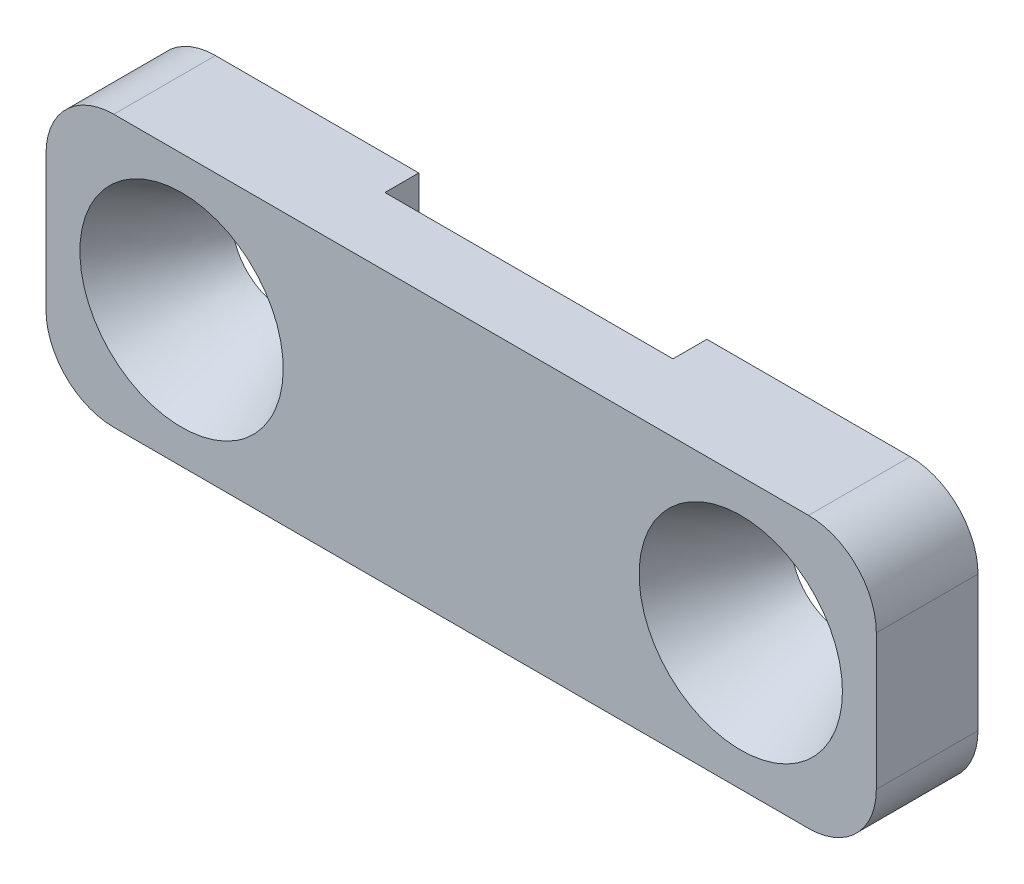
ISO-10303-21;
HEADER;
FILE_DESCRIPTION(('STEP AP214'),'2;1');
FILE_NAME('part.step','',(''),(''),'','','');
FILE_SCHEMA(('AUTOMOTIVE_DESIGN { 1 0 10303 214 1 1 1 1 }'));
ENDSEC;
DATA;
#1=APPLICATION_CONTEXT('core data for automotive mechanical design processes');
#2=APPLICATION_PROTOCOL_DEFINITION('international standard','automotive_design',2000,#1);
#3=PRODUCT_CONTEXT('',#1,'mechanical');
#4=PRODUCT('Part','Part','',(#3));
#5=PRODUCT_RELATED_PRODUCT_CATEGORY('part','',(#4));
#6=PRODUCT_DEFINITION_FORMATION('','',#4);
#7=PRODUCT_DEFINITION_CONTEXT('part definition',#1,'design');
#8=PRODUCT_DEFINITION('design','',#6,#7);
#9=PRODUCT_DEFINITION_SHAPE('','',#8);
#10=(LENGTH_UNIT() NAMED_UNIT(*) SI_UNIT(.MILLI.,.METRE.));
#11=(NAMED_UNIT(*) PLANE_ANGLE_UNIT() SI_UNIT($,.RADIAN.));
#12=(NAMED_UNIT(*) SI_UNIT($,.STERADIAN.) SOLID_ANGLE_UNIT());
#13=UNCERTAINTY_MEASURE_WITH_UNIT(LENGTH_MEASURE(1.E-05),#10,'distance_accuracy_value','');
#14=(GEOMETRIC_REPRESENTATION_CONTEXT(3) GLOBAL_UNCERTAINTY_ASSIGNED_CONTEXT((#13)) GLOBAL_UNIT_ASSIGNED_CONTEXT((#10,
#11,#12)) REPRESENTATION_CONTEXT('',''));
#15=CARTESIAN_POINT('',(0.,0.,0.));
#16=DIRECTION('',(0.,0.,1.));
#17=DIRECTION('',(1.,0.,0.));
#18=AXIS2_PLACEMENT_3D('',#15,#16,#17);
#19=CARTESIAN_POINT('',(-12.25,4.,3.));
#20=DIRECTION('',(0.,-1.,0.));
#21=DIRECTION('',(0.,0.,-1.));
#22=AXIS2_PLACEMENT_3D('',#19,#20,#21);
#23=PLANE('',#22);
#24=DIRECTION('',(-1.,0.,0.));
#25=VECTOR('',#24,1.);
#26=CARTESIAN_POINT('',(-12.25,4.,3.));
#27=LINE('',#26,#25);
#28=CARTESIAN_POINT('',(10.25,4.,3.));
#29=VERTEX_POINT('',#28);
#30=CARTESIAN_POINT('',(-10.25,4.,3.));
#31=VERTEX_POINT('',#30);
#32=EDGE_CURVE('E170',#29,#31,#27,.T.);
#33=ORIENTED_EDGE('',*,*,#32,.F.);
#34=DIRECTION('',(0.,0.,-1.));
#35=VECTOR('',#34,1.);
#36=CARTESIAN_POINT('',(10.25,4.,3.));
#37=LINE('',#36,#35);
#38=CARTESIAN_POINT('',(10.25,4.,0.));
#39=VERTEX_POINT('',#38);
#40=EDGE_CURVE('E230',#29,#39,#37,.T.);
#41=ORIENTED_EDGE('',*,*,#40,.T.);
#42=DIRECTION('',(-1.,0.,0.));
#43=VECTOR('',#42,1.);
#44=CARTESIAN_POINT('',(-12.25,4.,0.));
#45=LINE('',#44,#43);
#46=CARTESIAN_POINT('',(4.25,4.,0.));
#47=VERTEX_POINT('',#46);
#48=EDGE_CURVE('E184',#39,#47,#45,.T.);
#49=ORIENTED_EDGE('',*,*,#48,.T.);
#50=DIRECTION('',(0.,0.,-1.));
#51=VECTOR('',#50,1.);
#52=CARTESIAN_POINT('',(4.25,4.,1.));
#53=LINE('',#52,#51);
#54=CARTESIAN_POINT('',(4.25,4.,1.));
#55=VERTEX_POINT('',#54);
#56=EDGE_CURVE('E136',#55,#47,#53,.T.);
#57=ORIENTED_EDGE('',*,*,#56,.F.);
#58=DIRECTION('',(1.,0.,0.));
#59=VECTOR('',#58,1.);
#60=CARTESIAN_POINT('',(0.,4.,1.));
#61=LINE('',#60,#59);
#62=CARTESIAN_POINT('',(-4.25,4.,1.));
#63=VERTEX_POINT('',#62);
#64=EDGE_CURVE('E143',#63,#55,#61,.T.);
#65=ORIENTED_EDGE('',*,*,#64,.F.);
#66=DIRECTION('',(0.,0.,-1.));
#67=VECTOR('',#66,1.);
#68=CARTESIAN_POINT('',(-4.25,4.,1.));
#69=LINE('',#68,#67);
#70=CARTESIAN_POINT('',(-4.25,4.,0.));
#71=VERTEX_POINT('',#70);
#72=EDGE_CURVE('E124',#63,#71,#69,.T.);
#73=ORIENTED_EDGE('',*,*,#72,.T.);
#74=CARTESIAN_POINT('',(-10.25,4.,0.));
#75=VERTEX_POINT('',#74);
#76=EDGE_CURVE('E183',#71,#75,#45,.T.);
#77=ORIENTED_EDGE('',*,*,#76,.T.);
#78=DIRECTION('',(0.,0.,-1.));
#79=VECTOR('',#78,1.);
#80=CARTESIAN_POINT('',(-10.25,4.,3.));
#81=LINE('',#80,#79);
#82=EDGE_CURVE('E180',#75,#31,#81,.F.);
#83=ORIENTED_EDGE('',*,*,#82,.T.);
#84=EDGE_LOOP('',(#33,#41,#49,#57,#65,#73,#77,#83));
#85=FACE_BOUND('',#84,.T.);
#86=ADVANCED_FACE('F37',(#85),#23,.F.);
#87=CARTESIAN_POINT('',(-12.25,-4.,3.));
#88=DIRECTION('',(0.,1.,0.));
#89=DIRECTION('',(0.,0.,1.));
#90=AXIS2_PLACEMENT_3D('',#87,#88,#89);
#91=PLANE('',#90);
#92=DIRECTION('',(1.,0.,0.));
#93=VECTOR('',#92,1.);
#94=CARTESIAN_POINT('',(-12.25,-4.,0.));
#95=LINE('',#94,#93);
#96=CARTESIAN_POINT('',(4.25,-4.,0.));
#97=VERTEX_POINT('',#96);
#98=CARTESIAN_POINT('',(10.25,-4.,0.));
#99=VERTEX_POINT('',#98);
#100=EDGE_CURVE('E188',#97,#99,#95,.T.);
#101=ORIENTED_EDGE('',*,*,#100,.T.);
#102=DIRECTION('',(0.,0.,-1.));
#103=VECTOR('',#102,1.);
#104=CARTESIAN_POINT('',(10.25,-4.,3.));
#105=LINE('',#104,#103);
#106=CARTESIAN_POINT('',(10.25,-4.,3.));
#107=VERTEX_POINT('',#106);
#108=EDGE_CURVE('E253',#99,#107,#105,.F.);
#109=ORIENTED_EDGE('',*,*,#108,.T.);
#110=DIRECTION('',(1.,0.,0.));
#111=VECTOR('',#110,1.);
#112=CARTESIAN_POINT('',(-12.25,-4.,3.));
#113=LINE('',#112,#111);
#114=CARTESIAN_POINT('',(-10.25,-4.,3.));
#115=VERTEX_POINT('',#114);
#116=EDGE_CURVE('E177',#115,#107,#113,.T.);
#117=ORIENTED_EDGE('',*,*,#116,.F.);
#118=DIRECTION('',(0.,0.,-1.));
#119=VECTOR('',#118,1.);
#120=CARTESIAN_POINT('',(-10.25,-4.,3.));
#121=LINE('',#120,#119);
#122=CARTESIAN_POINT('',(-10.25,-4.,0.));
#123=VERTEX_POINT('',#122);
#124=EDGE_CURVE('E250',#115,#123,#121,.T.);
#125=ORIENTED_EDGE('',*,*,#124,.T.);
#126=CARTESIAN_POINT('',(-4.25,-4.,0.));
#127=VERTEX_POINT('',#126);
#128=EDGE_CURVE('E171',#123,#127,#95,.T.);
#129=ORIENTED_EDGE('',*,*,#128,.T.);
#130=DIRECTION('',(0.,0.,-1.));
#131=VECTOR('',#130,1.);
#132=CARTESIAN_POINT('',(-4.25,-4.,1.));
#133=LINE('',#132,#131);
#134=CARTESIAN_POINT('',(-4.25,-4.,1.));
#135=VERTEX_POINT('',#134);
#136=EDGE_CURVE('E160',#135,#127,#133,.T.);
#137=ORIENTED_EDGE('',*,*,#136,.F.);
#138=DIRECTION('',(-1.,0.,0.));
#139=VECTOR('',#138,1.);
#140=CARTESIAN_POINT('',(0.,-4.,1.));
#141=LINE('',#140,#139);
#142=CARTESIAN_POINT('',(4.25,-4.,1.));
#143=VERTEX_POINT('',#142);
#144=EDGE_CURVE('E137',#143,#135,#141,.T.);
#145=ORIENTED_EDGE('',*,*,#144,.F.);
#146=DIRECTION('',(0.,0.,-1.));
#147=VECTOR('',#146,1.);
#148=CARTESIAN_POINT('',(4.25,-4.,1.));
#149=LINE('',#148,#147);
#150=EDGE_CURVE('E163',#143,#97,#149,.T.);
#151=ORIENTED_EDGE('',*,*,#150,.T.);
#152=EDGE_LOOP('',(#101,#109,#117,#125,#129,#137,#145,#151));
#153=FACE_BOUND('',#152,.T.);
#154=ADVANCED_FACE('F286',(#153),#91,.F.);
#155=CARTESIAN_POINT('',(0.,0.,0.));
#156=DIRECTION('',(0.,0.,-1.));
#157=DIRECTION('',(-1.,0.,0.));
#158=AXIS2_PLACEMENT_3D('',#155,#156,#157);
#159=PLANE('',#158);
#160=CARTESIAN_POINT('',(-8.25,0.,0.));
#161=DIRECTION('',(0.,0.,-1.));
#162=DIRECTION('',(-1.,0.,0.));
#163=AXIS2_PLACEMENT_3D('',#160,#161,#162);
#164=CIRCLE('',#163,1.5);
#165=CARTESIAN_POINT('',(-8.70005985936191,1.43088997585109,0.));
#166=VERTEX_POINT('',#165);
#167=EDGE_CURVE('E158',#166,#166,#164,.T.);
#168=ORIENTED_EDGE('',*,*,#167,.F.);
#169=EDGE_LOOP('',(#168));
#170=FACE_BOUND('',#169,.T.);
#171=DIRECTION('',(0.,-1.,0.));
#172=VECTOR('',#171,1.);
#173=CARTESIAN_POINT('',(-12.25,-4.,0.));
#174=LINE('',#173,#172);
#175=CARTESIAN_POINT('',(-12.25,2.,0.));
#176=VERTEX_POINT('',#175);
#177=CARTESIAN_POINT('',(-12.25,-2.,0.));
#178=VERTEX_POINT('',#177);
#179=EDGE_CURVE('E186',#176,#178,#174,.T.);
#180=ORIENTED_EDGE('',*,*,#179,.F.);
#181=CARTESIAN_POINT('',(-10.25,2.,0.));
#182=DIRECTION('',(0.,0.,-1.));
#183=DIRECTION('',(-1.,0.,0.));
#184=AXIS2_PLACEMENT_3D('',#181,#182,#183);
#185=CIRCLE('',#184,2.);
#186=EDGE_CURVE('E12',#176,#75,#185,.T.);
#187=ORIENTED_EDGE('',*,*,#186,.T.);
#188=ORIENTED_EDGE('',*,*,#76,.F.);
#189=DIRECTION('',(0.,-1.,0.));
#190=VECTOR('',#189,1.);
#191=CARTESIAN_POINT('',(-4.25,0.,0.));
#192=LINE('',#191,#190);
#193=EDGE_CURVE('E131',#71,#127,#192,.T.);
#194=ORIENTED_EDGE('',*,*,#193,.T.);
#195=ORIENTED_EDGE('',*,*,#128,.F.);
#196=CARTESIAN_POINT('',(-10.25,-2.,0.));
#197=DIRECTION('',(0.,0.,-1.));
#198=DIRECTION('',(-1.,0.,0.));
#199=AXIS2_PLACEMENT_3D('',#196,#197,#198);
#200=CIRCLE('',#199,2.);
#201=EDGE_CURVE('E45',#123,#178,#200,.T.);
#202=ORIENTED_EDGE('',*,*,#201,.T.);
#203=EDGE_LOOP('',(#180,#187,#188,#194,#195,#202));
#204=FACE_BOUND('',#203,.T.);
#205=ADVANCED_FACE('F262',(#170,#204),#159,.T.);
#206=CARTESIAN_POINT('',(12.25,-4.,3.));
#207=DIRECTION('',(-1.,0.,0.));
#208=DIRECTION('',(0.,0.,1.));
#209=AXIS2_PLACEMENT_3D('',#206,#207,#208);
#210=PLANE('',#209);
#211=DIRECTION('',(0.,1.,0.));
#212=VECTOR('',#211,1.);
#213=CARTESIAN_POINT('',(12.25,-4.,0.));
#214=LINE('',#213,#212);
#215=CARTESIAN_POINT('',(12.25,-2.,0.));
#216=VERTEX_POINT('',#215);
#217=CARTESIAN_POINT('',(12.25,2.,0.));
#218=VERTEX_POINT('',#217);
#219=EDGE_CURVE('E162',#216,#218,#214,.T.);
#220=ORIENTED_EDGE('',*,*,#219,.T.);
#221=DIRECTION('',(0.,0.,-1.));
#222=VECTOR('',#221,1.);
#223=CARTESIAN_POINT('',(12.25,2.,3.));
#224=LINE('',#223,#222);
#225=CARTESIAN_POINT('',(12.25,2.,3.));
#226=VERTEX_POINT('',#225);
#227=EDGE_CURVE('E240',#218,#226,#224,.F.);
#228=ORIENTED_EDGE('',*,*,#227,.T.);
#229=DIRECTION('',(0.,1.,0.));
#230=VECTOR('',#229,1.);
#231=CARTESIAN_POINT('',(12.25,-4.,3.));
#232=LINE('',#231,#230);
#233=CARTESIAN_POINT('',(12.25,-2.,3.));
#234=VERTEX_POINT('',#233);
#235=EDGE_CURVE('E167',#234,#226,#232,.T.);
#236=ORIENTED_EDGE('',*,*,#235,.F.);
#237=DIRECTION('',(0.,0.,-1.));
#238=VECTOR('',#237,1.);
#239=CARTESIAN_POINT('',(12.25,-2.,3.));
#240=LINE('',#239,#238);
#241=EDGE_CURVE('E237',#234,#216,#240,.T.);
#242=ORIENTED_EDGE('',*,*,#241,.T.);
#243=EDGE_LOOP('',(#220,#228,#236,#242));
#244=FACE_BOUND('',#243,.T.);
#245=ADVANCED_FACE('F276',(#244),#210,.F.);
#246=CARTESIAN_POINT('',(-12.25,-4.,3.));
#247=DIRECTION('',(1.,0.,0.));
#248=DIRECTION('',(0.,0.,-1.));
#249=AXIS2_PLACEMENT_3D('',#246,#247,#248);
#250=PLANE('',#249);
#251=DIRECTION('',(0.,-1.,0.));
#252=VECTOR('',#251,1.);
#253=CARTESIAN_POINT('',(-12.25,-4.,3.));
#254=LINE('',#253,#252);
#255=CARTESIAN_POINT('',(-12.25,2.,3.));
#256=VERTEX_POINT('',#255);
#257=CARTESIAN_POINT('',(-12.25,-2.,3.));
#258=VERTEX_POINT('',#257);
#259=EDGE_CURVE('E174',#256,#258,#254,.T.);
#260=ORIENTED_EDGE('',*,*,#259,.F.);
#261=DIRECTION('',(0.,0.,-1.));
#262=VECTOR('',#261,1.);
#263=CARTESIAN_POINT('',(-12.25,2.,3.));
#264=LINE('',#263,#262);
#265=EDGE_CURVE('E257',#256,#176,#264,.T.);
#266=ORIENTED_EDGE('',*,*,#265,.T.);
#267=ORIENTED_EDGE('',*,*,#179,.T.);
#268=DIRECTION('',(0.,0.,-1.));
#269=VECTOR('',#268,1.);
#270=CARTESIAN_POINT('',(-12.25,-2.,3.));
#271=LINE('',#270,#269);
#272=EDGE_CURVE('E255',#178,#258,#271,.F.);
#273=ORIENTED_EDGE('',*,*,#272,.T.);
#274=EDGE_LOOP('',(#260,#266,#267,#273));
#275=FACE_BOUND('',#274,.T.);
#276=ADVANCED_FACE('F212',(#275),#250,.F.);
#277=CARTESIAN_POINT('',(0.,0.,3.));
#278=DIRECTION('',(0.,0.,-1.));
#279=DIRECTION('',(-1.,0.,0.));
#280=AXIS2_PLACEMENT_3D('',#277,#278,#279);
#281=PLANE('',#280);
#282=CARTESIAN_POINT('',(8.25,0.,3.));
#283=DIRECTION('',(0.,0.,1.));
#284=DIRECTION('',(1.,0.,0.));
#285=AXIS2_PLACEMENT_3D('',#282,#283,#284);
#286=CIRCLE('',#285,3.);
#287=CARTESIAN_POINT('',(11.25,0.,3.));
#288=VERTEX_POINT('',#287);
#289=EDGE_CURVE('E423',#288,#288,#286,.T.);
#290=ORIENTED_EDGE('',*,*,#289,.F.);
#291=EDGE_LOOP('',(#290));
#292=FACE_BOUND('',#291,.T.);
#293=CARTESIAN_POINT('',(-8.25,0.,3.));
#294=DIRECTION('',(0.,0.,1.));
#295=DIRECTION('',(1.,0.,0.));
#296=AXIS2_PLACEMENT_3D('',#293,#294,#295);
#297=CIRCLE('',#296,3.);
#298=CARTESIAN_POINT('',(-10.5531067863784,1.92242012331792,3.));
#299=VERTEX_POINT('',#298);
#300=EDGE_CURVE('E194',#299,#299,#297,.T.);
#301=ORIENTED_EDGE('',*,*,#300,.F.);
#302=EDGE_LOOP('',(#301));
#303=FACE_BOUND('',#302,.T.);
#304=ORIENTED_EDGE('',*,*,#235,.T.);
#305=CARTESIAN_POINT('',(10.25,2.,3.));
#306=DIRECTION('',(0.,0.,-1.));
#307=DIRECTION('',(-1.,0.,0.));
#308=AXIS2_PLACEMENT_3D('',#305,#306,#307);
#309=CIRCLE('',#308,2.);
#310=EDGE_CURVE('E248',#226,#29,#309,.F.);
#311=ORIENTED_EDGE('',*,*,#310,.T.);
#312=ORIENTED_EDGE('',*,*,#32,.T.);
#313=CARTESIAN_POINT('',(-10.25,2.,3.));
#314=DIRECTION('',(0.,0.,-1.));
#315=DIRECTION('',(-1.,0.,0.));
#316=AXIS2_PLACEMENT_3D('',#313,#314,#315);
#317=CIRCLE('',#316,2.);
#318=EDGE_CURVE('E244',#31,#256,#317,.F.);
#319=ORIENTED_EDGE('',*,*,#318,.T.);
#320=ORIENTED_EDGE('',*,*,#259,.T.);
#321=CARTESIAN_POINT('',(-10.25,-2.,3.));
#322=DIRECTION('',(0.,0.,-1.));
#323=DIRECTION('',(-1.,0.,0.));
#324=AXIS2_PLACEMENT_3D('',#321,#322,#323);
#325=CIRCLE('',#324,2.);
#326=EDGE_CURVE('E242',#258,#115,#325,.F.);
#327=ORIENTED_EDGE('',*,*,#326,.T.);
#328=ORIENTED_EDGE('',*,*,#116,.T.);
#329=CARTESIAN_POINT('',(10.25,-2.,3.));
#330=DIRECTION('',(0.,0.,-1.));
#331=DIRECTION('',(-1.,0.,0.));
#332=AXIS2_PLACEMENT_3D('',#329,#330,#331);
#333=CIRCLE('',#332,2.);
#334=EDGE_CURVE('E246',#107,#234,#333,.F.);
#335=ORIENTED_EDGE('',*,*,#334,.T.);
#336=EDGE_LOOP('',(#304,#311,#312,#319,#320,#327,#328,#335));
#337=FACE_BOUND('',#336,.T.);
#338=ADVANCED_FACE('F201',(#292,#303,#337),#281,.F.);
#339=CARTESIAN_POINT('',(8.25,0.,0.));
#340=DIRECTION('',(0.,0.,1.));
#341=DIRECTION('',(1.,0.,0.));
#342=AXIS2_PLACEMENT_3D('',#339,#340,#341);
#343=CIRCLE('',#342,1.5);
#344=CARTESIAN_POINT('',(9.75,0.,0.));
#345=VERTEX_POINT('',#344);
#346=EDGE_CURVE('E430',#345,#345,#343,.T.);
#347=ORIENTED_EDGE('',*,*,#346,.T.);
#348=EDGE_LOOP('',(#347));
#349=FACE_BOUND('',#348,.T.);
#350=ORIENTED_EDGE('',*,*,#48,.F.);
#351=CARTESIAN_POINT('',(10.25,2.,0.));
#352=DIRECTION('',(0.,0.,-1.));
#353=DIRECTION('',(-1.,0.,0.));
#354=AXIS2_PLACEMENT_3D('',#351,#352,#353);
#355=CIRCLE('',#354,2.);
#356=EDGE_CURVE('E235',#39,#218,#355,.T.);
#357=ORIENTED_EDGE('',*,*,#356,.T.);
#358=ORIENTED_EDGE('',*,*,#219,.F.);
#359=CARTESIAN_POINT('',(10.25,-2.,0.));
#360=DIRECTION('',(0.,0.,-1.));
#361=DIRECTION('',(-1.,0.,0.));
#362=AXIS2_PLACEMENT_3D('',#359,#360,#361);
#363=CIRCLE('',#362,2.);
#364=EDGE_CURVE('E233',#216,#99,#363,.T.);
#365=ORIENTED_EDGE('',*,*,#364,.T.);
#366=ORIENTED_EDGE('',*,*,#100,.F.);
#367=DIRECTION('',(0.,-1.,0.));
#368=VECTOR('',#367,1.);
#369=CARTESIAN_POINT('',(4.25,0.,0.));
#370=LINE('',#369,#368);
#371=EDGE_CURVE('E147',#47,#97,#370,.T.);
#372=ORIENTED_EDGE('',*,*,#371,.F.);
#373=EDGE_LOOP('',(#350,#357,#358,#365,#366,#372));
#374=FACE_BOUND('',#373,.T.);
#375=ADVANCED_FACE('F211',(#349,#374),#159,.T.);
#376=CARTESIAN_POINT('',(-4.25,0.,1.));
#377=DIRECTION('',(1.,0.,0.));
#378=DIRECTION('',(0.,0.,-1.));
#379=AXIS2_PLACEMENT_3D('',#376,#377,#378);
#380=PLANE('',#379);
#381=ORIENTED_EDGE('',*,*,#193,.F.);
#382=ORIENTED_EDGE('',*,*,#72,.F.);
#383=DIRECTION('',(0.,-1.,0.));
#384=VECTOR('',#383,1.);
#385=CARTESIAN_POINT('',(-4.25,0.,1.));
#386=LINE('',#385,#384);
#387=EDGE_CURVE('E128',#63,#135,#386,.T.);
#388=ORIENTED_EDGE('',*,*,#387,.T.);
#389=ORIENTED_EDGE('',*,*,#136,.T.);
#390=EDGE_LOOP('',(#381,#382,#388,#389));
#391=FACE_BOUND('',#390,.T.);
#392=ADVANCED_FACE('F126',(#391),#380,.T.);
#393=CARTESIAN_POINT('',(4.25,0.,1.));
#394=DIRECTION('',(1.,0.,0.));
#395=DIRECTION('',(0.,0.,-1.));
#396=AXIS2_PLACEMENT_3D('',#393,#394,#395);
#397=PLANE('',#396);
#398=ORIENTED_EDGE('',*,*,#371,.T.);
#399=ORIENTED_EDGE('',*,*,#150,.F.);
#400=DIRECTION('',(0.,-1.,0.));
#401=VECTOR('',#400,1.);
#402=CARTESIAN_POINT('',(4.25,0.,1.));
#403=LINE('',#402,#401);
#404=EDGE_CURVE('E151',#55,#143,#403,.T.);
#405=ORIENTED_EDGE('',*,*,#404,.F.);
#406=ORIENTED_EDGE('',*,*,#56,.T.);
#407=EDGE_LOOP('',(#398,#399,#405,#406));
#408=FACE_BOUND('',#407,.T.);
#409=ADVANCED_FACE('F289',(#408),#397,.F.);
#410=CARTESIAN_POINT('',(0.,0.,1.));
#411=DIRECTION('',(0.,0.,-1.));
#412=DIRECTION('',(-1.,0.,0.));
#413=AXIS2_PLACEMENT_3D('',#410,#411,#412);
#414=PLANE('',#413);
#415=ORIENTED_EDGE('',*,*,#387,.F.);
#416=ORIENTED_EDGE('',*,*,#64,.T.);
#417=ORIENTED_EDGE('',*,*,#404,.T.);
#418=ORIENTED_EDGE('',*,*,#144,.T.);
#419=EDGE_LOOP('',(#415,#416,#417,#418));
#420=FACE_BOUND('',#419,.T.);
#421=ADVANCED_FACE('F141',(#420),#414,.T.);
#422=CARTESIAN_POINT('',(-10.5531067863784,1.92242012331792,3.));
#423=CARTESIAN_POINT('',(-8.70005985936191,1.43088997585109,0.));
#424=CARTESIAN_POINT('',(-6.70826653974259,6.52863369607475,3.));
#425=CARTESIAN_POINT('',(-5.83827990765973,2.33100969457492,0.));
#426=CARTESIAN_POINT('',(-2.10205296698575,2.68379344943892,3.));
#427=CARTESIAN_POINT('',(-4.93816018893591,-0.530770257127263,0.));
#428=CARTESIAN_POINT('',(-5.94689321362158,-1.92242012331792,3.));
#429=CARTESIAN_POINT('',(-7.79994014063809,-1.43088997585109,0.));
#430=CARTESIAN_POINT('',(-9.79173346025742,-6.52863369607476,3.));
#431=CARTESIAN_POINT('',(-10.6617200923403,-2.33100969457492,0.));
#432=CARTESIAN_POINT('',(-14.3979470330143,-2.68379344943892,3.));
#433=CARTESIAN_POINT('',(-11.5618398110641,0.530770257127262,0.));
#434=CARTESIAN_POINT('',(-10.5531067863784,1.92242012331792,3.));
#435=CARTESIAN_POINT('',(-8.70005985936191,1.43088997585109,0.));
#436=(BOUNDED_SURFACE() B_SPLINE_SURFACE(3,1,((#422,#423),(#424,#425),(#426,#427),(#428,#429),
(#430,#431),(#432,#433),(#434,#435)),.UNSPECIFIED.,.T.,.F.,.F.) B_SPLINE_SURFACE_WITH_KNOTS((4,
3,4),(2,2),(0.,0.5,1.),(0.,1.),
.UNSPECIFIED.) GEOMETRIC_REPRESENTATION_ITEM() RATIONAL_B_SPLINE_SURFACE(((1.,1.),
(0.333333333333333,0.333333333333333),(0.333333333333333,0.333333333333333),(1.,1.),
(0.333333333333333,0.333333333333333),(0.333333333333333,0.333333333333333),(1.,1.))) REPRESENTATION_ITEM('') SURFACE());
#437=CARTESIAN_POINT('',(-10.5531067863784,1.92242012331792,3.));
#438=CARTESIAN_POINT('',(-10.533804214222,1.91730001761514,2.96875));
#439=CARTESIAN_POINT('',(-10.5145016420656,1.91217991191236,2.9375));
#440=CARTESIAN_POINT('',(-10.4758964977527,1.9019397005068,2.875));
#441=CARTESIAN_POINT('',(-10.4565939255963,1.89681959480402,2.84375));
#442=CARTESIAN_POINT('',(-10.4179887812835,1.88657938339846,2.78125));
#443=CARTESIAN_POINT('',(-10.398686209127,1.88145927769568,2.75));
#444=CARTESIAN_POINT('',(-10.3600810648142,1.87121906629012,2.6875));
#445=CARTESIAN_POINT('',(-10.3407784926578,1.86609896058734,2.65625));
#446=CARTESIAN_POINT('',(-10.3021733483449,1.85585874918178,2.59375));
#447=CARTESIAN_POINT('',(-10.2828707761885,1.850738643479,2.5625));
#448=CARTESIAN_POINT('',(-10.2442656318757,1.84049843207345,2.5));
#449=CARTESIAN_POINT('',(-10.2249630597192,1.83537832637067,2.46875));
#450=CARTESIAN_POINT('',(-10.1863579154064,1.82513811496511,2.40625));
#451=CARTESIAN_POINT('',(-10.16705534325,1.82001800926233,2.375));
#452=CARTESIAN_POINT('',(-10.1284501989371,1.80977779785677,2.3125));
#453=CARTESIAN_POINT('',(-10.1091476267807,1.80465769215399,2.28125));
#454=CARTESIAN_POINT('',(-10.0705424824679,1.79441748074843,2.21875));
#455=CARTESIAN_POINT('',(-10.0512399103114,1.78929737504565,2.1875));
#456=CARTESIAN_POINT('',(-10.0126347659986,1.77905716364009,2.125));
#457=CARTESIAN_POINT('',(-9.99333219384218,1.77393705793731,2.09375));
#458=CARTESIAN_POINT('',(-9.95472704952934,1.76369684653175,2.03125));
#459=CARTESIAN_POINT('',(-9.93542447737292,1.75857674082897,2.));
#460=CARTESIAN_POINT('',(-9.89681933306007,1.74833652942342,1.9375));
#461=CARTESIAN_POINT('',(-9.87751676090365,1.74321642372064,1.90625));
#462=CARTESIAN_POINT('',(-9.83891161659081,1.73297621231508,1.84375));
#463=CARTESIAN_POINT('',(-9.81960904443439,1.7278561066123,1.8125));
#464=CARTESIAN_POINT('',(-9.78100390012154,1.71761589520674,1.75));
#465=CARTESIAN_POINT('',(-9.76170132796512,1.71249578950396,1.71875));
#466=CARTESIAN_POINT('',(-9.72309618365228,1.7022555780984,1.65625));
#467=CARTESIAN_POINT('',(-9.70379361149585,1.69713547239562,1.625));
#468=CARTESIAN_POINT('',(-9.66518846718301,1.68689526099006,1.5625));
#469=CARTESIAN_POINT('',(-9.64588589502659,1.68177515528728,1.53125));
#470=CARTESIAN_POINT('',(-9.60728075071374,1.67153494388172,1.46875));
#471=CARTESIAN_POINT('',(-9.58797817855732,1.66641483817894,1.4375));
#472=CARTESIAN_POINT('',(-9.54937303424448,1.65617462677339,1.375));
#473=CARTESIAN_POINT('',(-9.53007046208806,1.65105452107061,1.34375));
#474=CARTESIAN_POINT('',(-9.49146531777521,1.64081430966505,1.28125));
#475=CARTESIAN_POINT('',(-9.47216274561879,1.63569420396227,1.25));
#476=CARTESIAN_POINT('',(-9.43355760130595,1.62545399255671,1.1875));
#477=CARTESIAN_POINT('',(-9.41425502914952,1.62033388685393,1.15625));
#478=CARTESIAN_POINT('',(-9.37564988483668,1.61009367544837,1.09375));
#479=CARTESIAN_POINT('',(-9.35634731268026,1.60497356974559,1.0625));
#480=CARTESIAN_POINT('',(-9.31774216836742,1.59473335834003,1.));
#481=CARTESIAN_POINT('',(-9.29843959621099,1.58961325263725,0.96875));
#482=CARTESIAN_POINT('',(-9.25983445189815,1.57937304123169,0.90625));
#483=CARTESIAN_POINT('',(-9.24053187974173,1.57425293552891,0.875));
#484=CARTESIAN_POINT('',(-9.20192673542888,1.56401272412336,0.8125));
#485=CARTESIAN_POINT('',(-9.18262416327246,1.55889261842058,0.78125));
#486=CARTESIAN_POINT('',(-9.14401901895962,1.54865240701502,0.71875));
#487=CARTESIAN_POINT('',(-9.1247164468032,1.54353230131224,0.6875));
#488=CARTESIAN_POINT('',(-9.08611130249035,1.53329208990668,0.625));
#489=CARTESIAN_POINT('',(-9.06680873033393,1.5281719842039,0.59375));
#490=CARTESIAN_POINT('',(-9.02820358602109,1.51793177279834,0.53125));
#491=CARTESIAN_POINT('',(-9.00890101386467,1.51281166709556,0.5));
#492=CARTESIAN_POINT('',(-8.97029586955182,1.50257145569,0.4375));
#493=CARTESIAN_POINT('',(-8.9509932973954,1.49745134998722,0.40625));
#494=CARTESIAN_POINT('',(-8.91238815308256,1.48721113858166,0.34375));
#495=CARTESIAN_POINT('',(-8.89308558092613,1.48209103287888,0.3125));
#496=CARTESIAN_POINT('',(-8.85448043661329,1.47185082147333,0.25));
#497=CARTESIAN_POINT('',(-8.83517786445687,1.46673071577055,0.21875));
#498=CARTESIAN_POINT('',(-8.79657272014402,1.45649050436499,0.15625));
#499=CARTESIAN_POINT('',(-8.7772701479876,1.45137039866221,0.125));
#500=CARTESIAN_POINT('',(-8.73866500367476,1.44113018725665,0.0624999999999995));
#501=CARTESIAN_POINT('',(-8.71936243151834,1.43601008155387,0.0312499999999992));
#502=CARTESIAN_POINT('',(-8.70005985936191,1.43088997585109,0.));
#503=B_SPLINE_CURVE_WITH_KNOTS('',3,(#437,#438,#439,#440,#441,#442,#443,#444,#445,#446,#447,
#448,#449,#450,#451,#452,#453,#454,#455,#456,#457,#458,#459,#460,#461,#462,#463,#464,#465,#466,
#467,#468,#469,#470,#471,#472,#473,#474,#475,#476,#477,#478,#479,#480,#481,#482,#483,#484,#485,
#486,#487,#488,#489,#490,#491,#492,#493,#494,#495,#496,#497,#498,#499,#500,#501,#502),
.UNSPECIFIED.,.F.,.F.,(4,2,2,2,2,2,2,2,2,2,2,2,2,2,2,2,2,2,2,2,2,2,2,2,2,2,2,2,2,2,2,2,4),(0.,
0.111257833289858,0.222515666579713,0.333773499869571,0.445031333159427,0.556289166449284,
0.667546999739142,0.778804833028998,0.890062666318856,1.00132049960871,1.11257833289857,
1.22383616618843,1.33509399947828,1.44635183276814,1.557609666058,1.66886749934785,
1.78012533263771,1.89138316592757,2.00264099921742,2.11389883250728,2.22515666579714,
2.33641449908699,2.44767233237685,2.55893016566671,2.67018799895657,2.78144583224642,
2.89270366553628,3.00396149882613,3.11521933211599,3.22647716540585,3.33773499869571,
3.44899283198556,3.56025066527542),.UNSPECIFIED.);
#504=EDGE_CURVE('BSEAM295',#299,#166,#503,.T.);
#505=ORIENTED_EDGE('',*,*,#300,.T.);
#506=ORIENTED_EDGE('',*,*,#167,.T.);
#507=ORIENTED_EDGE('',*,*,#504,.T.);
#508=ORIENTED_EDGE('',*,*,#504,.F.);
#509=EDGE_LOOP('',(#505,#507,#506,#508));
#510=FACE_BOUND('',#509,.T.);
#511=ADVANCED_FACE('F295',(#510),#436,.F.);
#512=CARTESIAN_POINT('',(8.25,0.,0.));
#513=DIRECTION('',(0.,0.,1.));
#514=DIRECTION('',(1.,0.,0.));
#515=AXIS2_PLACEMENT_3D('',#512,#513,#514);
#516=CONICAL_SURFACE('',#515,1.5,0.463647609000806);
#517=ORIENTED_EDGE('',*,*,#289,.T.);
#518=EDGE_LOOP('',(#517));
#519=FACE_BOUND('',#518,.T.);
#520=ORIENTED_EDGE('',*,*,#346,.F.);
#521=EDGE_LOOP('',(#520));
#522=FACE_BOUND('',#521,.T.);
#523=ADVANCED_FACE('F309',(#519,#522),#516,.F.);
#524=CARTESIAN_POINT('',(10.25,2.,3.));
#525=DIRECTION('',(0.,0.,-1.));
#526=DIRECTION('',(-1.,0.,0.));
#527=AXIS2_PLACEMENT_3D('',#524,#525,#526);
#528=CYLINDRICAL_SURFACE('',#527,2.);
#529=ORIENTED_EDGE('',*,*,#310,.F.);
#530=ORIENTED_EDGE('',*,*,#227,.F.);
#531=ORIENTED_EDGE('',*,*,#356,.F.);
#532=ORIENTED_EDGE('',*,*,#40,.F.);
#533=EDGE_LOOP('',(#529,#530,#531,#532));
#534=FACE_BOUND('',#533,.T.);
#535=ADVANCED_FACE('F270',(#534),#528,.T.);
#536=CARTESIAN_POINT('',(10.25,-2.,3.));
#537=DIRECTION('',(0.,0.,-1.));
#538=DIRECTION('',(-1.,0.,0.));
#539=AXIS2_PLACEMENT_3D('',#536,#537,#538);
#540=CYLINDRICAL_SURFACE('',#539,2.);
#541=ORIENTED_EDGE('',*,*,#334,.F.);
#542=ORIENTED_EDGE('',*,*,#108,.F.);
#543=ORIENTED_EDGE('',*,*,#364,.F.);
#544=ORIENTED_EDGE('',*,*,#241,.F.);
#545=EDGE_LOOP('',(#541,#542,#543,#544));
#546=FACE_BOUND('',#545,.T.);
#547=ADVANCED_FACE('F281',(#546),#540,.T.);
#548=CARTESIAN_POINT('',(-10.25,2.,3.));
#549=DIRECTION('',(0.,0.,-1.));
#550=DIRECTION('',(-1.,0.,0.));
#551=AXIS2_PLACEMENT_3D('',#548,#549,#550);
#552=CYLINDRICAL_SURFACE('',#551,2.);
#553=ORIENTED_EDGE('',*,*,#318,.F.);
#554=ORIENTED_EDGE('',*,*,#82,.F.);
#555=ORIENTED_EDGE('',*,*,#186,.F.);
#556=ORIENTED_EDGE('',*,*,#265,.F.);
#557=EDGE_LOOP('',(#553,#554,#555,#556));
#558=FACE_BOUND('',#557,.T.);
#559=ADVANCED_FACE('F263',(#558),#552,.T.);
#560=CARTESIAN_POINT('',(-10.25,-2.,3.));
#561=DIRECTION('',(0.,0.,-1.));
#562=DIRECTION('',(-1.,0.,0.));
#563=AXIS2_PLACEMENT_3D('',#560,#561,#562);
#564=CYLINDRICAL_SURFACE('',#563,2.);
#565=ORIENTED_EDGE('',*,*,#326,.F.);
#566=ORIENTED_EDGE('',*,*,#272,.F.);
#567=ORIENTED_EDGE('',*,*,#201,.F.);
#568=ORIENTED_EDGE('',*,*,#124,.F.);
#569=EDGE_LOOP('',(#565,#566,#567,#568));
#570=FACE_BOUND('',#569,.T.);
#571=ADVANCED_FACE('F39',(#570),#564,.T.);
#572=CLOSED_SHELL('',(#86,#154,#205,#245,#276,#338,#375,#392,#409,#421,#511,#523,#535,#547,#559,#571));
#573=MANIFOLD_SOLID_BREP('B2',#572);
#574=ADVANCED_BREP_SHAPE_REPRESENTATION('',(#18,#573),#14);
#575=SHAPE_DEFINITION_REPRESENTATION(#9,#574);
ENDSEC;
END-ISO-10303-21;
